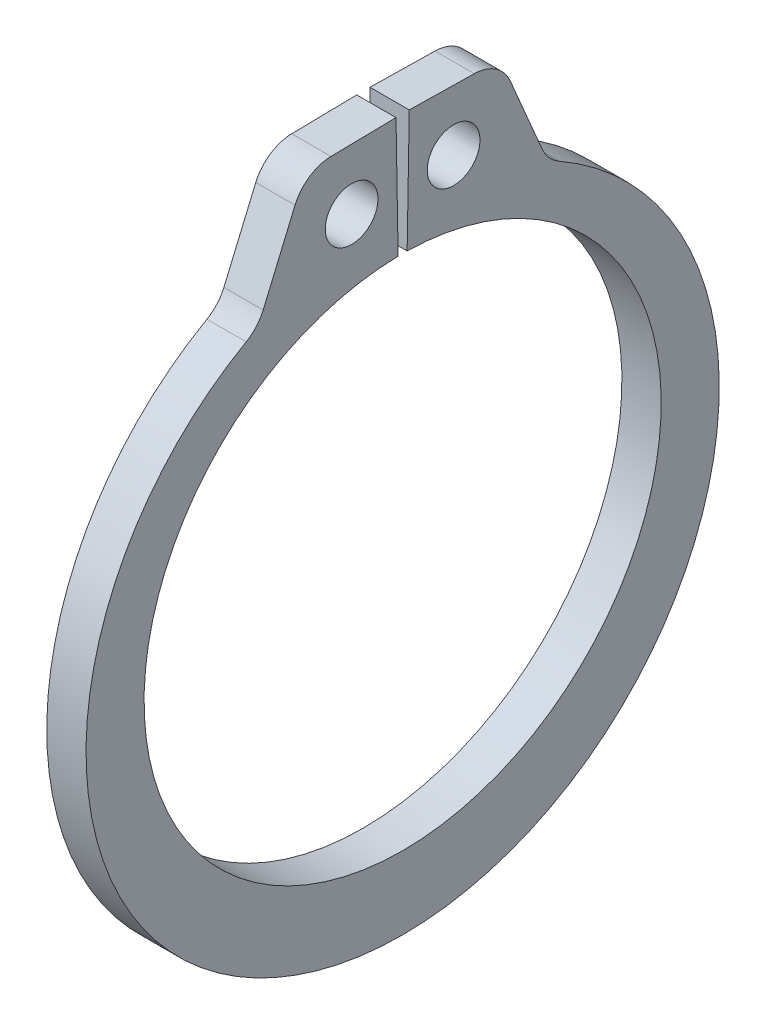
ISO-10303-21;
HEADER;
FILE_DESCRIPTION(('STEP AP214'),'2;1');
FILE_NAME('part.step','',(''),(''),'','','');
FILE_SCHEMA(('AUTOMOTIVE_DESIGN { 1 0 10303 214 1 1 1 1 }'));
ENDSEC;
DATA;
#1=APPLICATION_CONTEXT('core data for automotive mechanical design processes');
#2=APPLICATION_PROTOCOL_DEFINITION('international standard','automotive_design',2000,#1);
#3=PRODUCT_CONTEXT('',#1,'mechanical');
#4=PRODUCT('Part','Part','',(#3));
#5=PRODUCT_RELATED_PRODUCT_CATEGORY('part','',(#4));
#6=PRODUCT_DEFINITION_FORMATION('','',#4);
#7=PRODUCT_DEFINITION_CONTEXT('part definition',#1,'design');
#8=PRODUCT_DEFINITION('design','',#6,#7);
#9=PRODUCT_DEFINITION_SHAPE('','',#8);
#10=(LENGTH_UNIT() NAMED_UNIT(*) SI_UNIT(.MILLI.,.METRE.));
#11=(NAMED_UNIT(*) PLANE_ANGLE_UNIT() SI_UNIT($,.RADIAN.));
#12=(NAMED_UNIT(*) SI_UNIT($,.STERADIAN.) SOLID_ANGLE_UNIT());
#13=UNCERTAINTY_MEASURE_WITH_UNIT(LENGTH_MEASURE(1.E-05),#10,'distance_accuracy_value','');
#14=(GEOMETRIC_REPRESENTATION_CONTEXT(3) GLOBAL_UNCERTAINTY_ASSIGNED_CONTEXT((#13)) GLOBAL_UNIT_ASSIGNED_CONTEXT((#10,
#11,#12)) REPRESENTATION_CONTEXT('',''));
#15=CARTESIAN_POINT('',(0.,0.,0.));
#16=DIRECTION('',(0.,0.,1.));
#17=DIRECTION('',(1.,0.,0.));
#18=AXIS2_PLACEMENT_3D('',#15,#16,#17);
#19=CARTESIAN_POINT('',(-0.4445,0.,0.));
#20=DIRECTION('',(1.,0.,0.));
#21=DIRECTION('',(0.,0.,-1.));
#22=AXIS2_PLACEMENT_3D('',#19,#20,#21);
#23=PLANE('',#22);
#24=CARTESIAN_POINT('',(-0.4445,7.20724610900658,-1.15465964864512));
#25=DIRECTION('',(-1.,0.,0.));
#26=DIRECTION('',(0.,0.,1.));
#27=AXIS2_PLACEMENT_3D('',#24,#25,#26);
#28=CIRCLE('',#27,0.5969);
#29=CARTESIAN_POINT('',(-0.4445,7.20724610900658,-0.557759648645124));
#30=VERTEX_POINT('',#29);
#31=EDGE_CURVE('E132',#30,#30,#28,.F.);
#32=ORIENTED_EDGE('',*,*,#31,.T.);
#33=EDGE_LOOP('',(#32));
#34=FACE_BOUND('',#33,.T.);
#35=CARTESIAN_POINT('',(-0.4445,7.66933071962558,1.60650376158788));
#36=DIRECTION('',(-1.,0.,0.));
#37=DIRECTION('',(0.,0.,1.));
#38=AXIS2_PLACEMENT_3D('',#35,#36,#37);
#39=CIRCLE('',#38,0.9017);
#40=CARTESIAN_POINT('',(-0.4445,8.5708933863481,1.62224059647238));
#41=VERTEX_POINT('',#40);
#42=CARTESIAN_POINT('',(-0.4445,8.02240621636442,2.43620285379096));
#43=VERTEX_POINT('',#42);
#44=EDGE_CURVE('E102',#41,#43,#39,.F.);
#45=ORIENTED_EDGE('',*,*,#44,.F.);
#46=DIRECTION('',(0.,0.01745240643729,-0.999847695156391));
#47=VECTOR('',#46,1.);
#48=CARTESIAN_POINT('',(-0.4445,8.59659049818515,0.15005404530712));
#49=LINE('',#48,#47);
#50=CARTESIAN_POINT('',(-0.4445,8.59659049818515,0.15005404530712));
#51=VERTEX_POINT('',#50);
#52=EDGE_CURVE('E97',#41,#51,#49,.T.);
#53=ORIENTED_EDGE('',*,*,#52,.T.);
#54=DIRECTION('',(0.,-0.999847695156391,-0.0174524064372833));
#55=VECTOR('',#54,1.);
#56=CARTESIAN_POINT('',(-0.4445,5.85380830083213,0.102178603968365));
#57=LINE('',#56,#55);
#58=CARTESIAN_POINT('',(-0.4445,5.85380830083213,0.102178603968365));
#59=VERTEX_POINT('',#58);
#60=EDGE_CURVE('E129',#51,#59,#57,.T.);
#61=ORIENTED_EDGE('',*,*,#60,.T.);
#62=CARTESIAN_POINT('',(-0.4445,0.,0.));
#63=DIRECTION('',(-1.,0.,0.));
#64=DIRECTION('',(0.,0.,1.));
#65=AXIS2_PLACEMENT_3D('',#62,#63,#64);
#66=CIRCLE('',#65,5.8547);
#67=CARTESIAN_POINT('',(-0.4445,5.85380830083213,-0.102178603968365));
#68=VERTEX_POINT('',#67);
#69=EDGE_CURVE('E179',#59,#68,#66,.F.);
#70=ORIENTED_EDGE('',*,*,#69,.T.);
#71=DIRECTION('',(0.,0.999847695156391,-0.0174524064372833));
#72=VECTOR('',#71,1.);
#73=CARTESIAN_POINT('',(-0.4445,5.85380830083213,-0.102178603968365));
#74=LINE('',#73,#72);
#75=CARTESIAN_POINT('',(-0.4445,8.59659049818515,-0.15005404530712));
#76=VERTEX_POINT('',#75);
#77=EDGE_CURVE('E139',#68,#76,#74,.T.);
#78=ORIENTED_EDGE('',*,*,#77,.T.);
#79=DIRECTION('',(0.,-0.01745240643729,-0.999847695156391));
#80=VECTOR('',#79,1.);
#81=CARTESIAN_POINT('',(-0.4445,8.59659049818515,-0.15005404530712));
#82=LINE('',#81,#80);
#83=CARTESIAN_POINT('',(-0.4445,8.5708933863481,-1.62224059647238));
#84=VERTEX_POINT('',#83);
#85=EDGE_CURVE('E146',#76,#84,#82,.T.);
#86=ORIENTED_EDGE('',*,*,#85,.T.);
#87=CARTESIAN_POINT('',(-0.4445,7.66933071962558,-1.60650376158788));
#88=DIRECTION('',(-1.,0.,0.));
#89=DIRECTION('',(0.,0.,1.));
#90=AXIS2_PLACEMENT_3D('',#87,#88,#89);
#91=CIRCLE('',#90,0.9017);
#92=CARTESIAN_POINT('',(-0.4445,8.02240621636442,-2.43620285379096));
#93=VERTEX_POINT('',#92);
#94=EDGE_CURVE('E149',#93,#84,#91,.F.);
#95=ORIENTED_EDGE('',*,*,#94,.F.);
#96=DIRECTION('',(0.,-0.920149819455567,-0.391566481910656));
#97=VECTOR('',#96,1.);
#98=CARTESIAN_POINT('',(-0.4445,8.56068391718107,-2.20714069332188));
#99=LINE('',#98,#97);
#100=CARTESIAN_POINT('',(-0.4445,6.32616456625773,-3.15803245301383));
#101=VERTEX_POINT('',#100);
#102=EDGE_CURVE('E152',#93,#101,#99,.T.);
#103=ORIENTED_EDGE('',*,*,#102,.T.);
#104=CARTESIAN_POINT('',(-0.4445,6.67924006299657,-3.98773154521692));
#105=DIRECTION('',(-1.,0.,0.));
#106=DIRECTION('',(0.,0.,1.));
#107=AXIS2_PLACEMENT_3D('',#104,#105,#106);
#108=CIRCLE('',#107,0.9017);
#109=CARTESIAN_POINT('',(-0.4445,5.89530863003734,-3.54218199868087));
#110=VERTEX_POINT('',#109);
#111=EDGE_CURVE('E185',#101,#110,#108,.F.);
#112=ORIENTED_EDGE('',*,*,#111,.T.);
#113=CARTESIAN_POINT('',(-0.4445,-0.337057291142251,0.));
#114=DIRECTION('',(-1.,0.,0.));
#115=DIRECTION('',(0.,0.,1.));
#116=AXIS2_PLACEMENT_3D('',#113,#114,#115);
#117=CIRCLE('',#116,7.16864270885775);
#118=CARTESIAN_POINT('',(-0.4445,5.89530863003733,3.54218199868087));
#119=VERTEX_POINT('',#118);
#120=EDGE_CURVE('E187',#119,#110,#117,.F.);
#121=ORIENTED_EDGE('',*,*,#120,.F.);
#122=CARTESIAN_POINT('',(-0.4445,6.67924006299657,3.98773154521692));
#123=DIRECTION('',(-1.,0.,0.));
#124=DIRECTION('',(0.,0.,1.));
#125=AXIS2_PLACEMENT_3D('',#122,#123,#124);
#126=CIRCLE('',#125,0.9017);
#127=CARTESIAN_POINT('',(-0.4445,6.32616456625773,3.15803245301383));
#128=VERTEX_POINT('',#127);
#129=EDGE_CURVE('E115',#119,#128,#126,.F.);
#130=ORIENTED_EDGE('',*,*,#129,.T.);
#131=DIRECTION('',(0.,0.920149819455567,-0.391566481910656));
#132=VECTOR('',#131,1.);
#133=CARTESIAN_POINT('',(-0.4445,8.56068391718107,2.20714069332188));
#134=LINE('',#133,#132);
#135=EDGE_CURVE('E112',#128,#43,#134,.T.);
#136=ORIENTED_EDGE('',*,*,#135,.T.);
#137=EDGE_LOOP('',(#45,#53,#61,#70,#78,#86,#95,#103,#112,#121,#130,#136));
#138=FACE_BOUND('',#137,.T.);
#139=CARTESIAN_POINT('',(-0.4445,7.20724610900658,1.15465964864512));
#140=DIRECTION('',(-1.,0.,0.));
#141=DIRECTION('',(0.,0.,1.));
#142=AXIS2_PLACEMENT_3D('',#139,#140,#141);
#143=CIRCLE('',#142,0.5969);
#144=CARTESIAN_POINT('',(-0.4445,7.20724610900658,1.75155964864512));
#145=VERTEX_POINT('',#144);
#146=EDGE_CURVE('E19',#145,#145,#143,.F.);
#147=ORIENTED_EDGE('',*,*,#146,.T.);
#148=EDGE_LOOP('',(#147));
#149=FACE_BOUND('',#148,.T.);
#150=ADVANCED_FACE('F16',(#34,#138,#149),#23,.F.);
#151=CARTESIAN_POINT('',(0.4445,7.20724610900658,1.15465964864512));
#152=DIRECTION('',(-1.,0.,0.));
#153=DIRECTION('',(0.,0.,1.));
#154=AXIS2_PLACEMENT_3D('',#151,#152,#153);
#155=CYLINDRICAL_SURFACE('',#154,0.5969);
#156=CARTESIAN_POINT('',(0.4445,7.20724610900658,1.15465964864512));
#157=DIRECTION('',(-1.,0.,0.));
#158=DIRECTION('',(0.,0.,1.));
#159=AXIS2_PLACEMENT_3D('',#156,#157,#158);
#160=CIRCLE('',#159,0.5969);
#161=CARTESIAN_POINT('',(0.4445,7.20724610900658,1.75155964864512));
#162=VERTEX_POINT('',#161);
#163=EDGE_CURVE('E174',#162,#162,#160,.T.);
#164=ORIENTED_EDGE('',*,*,#163,.F.);
#165=EDGE_LOOP('',(#164));
#166=FACE_BOUND('',#165,.T.);
#167=ORIENTED_EDGE('',*,*,#146,.F.);
#168=EDGE_LOOP('',(#167));
#169=FACE_BOUND('',#168,.T.);
#170=ADVANCED_FACE('F387',(#166,#169),#155,.F.);
#171=CARTESIAN_POINT('',(0.4445,8.59659049818515,0.15005404530712));
#172=DIRECTION('',(0.,-0.999847695156391,-0.01745240643729));
#173=DIRECTION('',(0.,0.01745240643729,-0.999847695156391));
#174=AXIS2_PLACEMENT_3D('',#171,#172,#173);
#175=PLANE('',#174);
#176=DIRECTION('',(-1.,0.,0.));
#177=VECTOR('',#176,1.);
#178=CARTESIAN_POINT('',(0.4445,8.5708933863481,1.62224059647238));
#179=LINE('',#178,#177);
#180=CARTESIAN_POINT('',(0.4445,8.5708933863481,1.62224059647238));
#181=VERTEX_POINT('',#180);
#182=EDGE_CURVE('E109',#181,#41,#179,.T.);
#183=ORIENTED_EDGE('',*,*,#182,.F.);
#184=DIRECTION('',(0.,-0.0174524064372901,0.999847695156391));
#185=VECTOR('',#184,1.);
#186=CARTESIAN_POINT('',(0.4445,8.59659049818515,0.15005404530712));
#187=LINE('',#186,#185);
#188=CARTESIAN_POINT('',(0.4445,8.59659049818515,0.15005404530712));
#189=VERTEX_POINT('',#188);
#190=EDGE_CURVE('E173',#189,#181,#187,.T.);
#191=ORIENTED_EDGE('',*,*,#190,.F.);
#192=DIRECTION('',(1.,0.,0.));
#193=VECTOR('',#192,1.);
#194=CARTESIAN_POINT('',(0.4445,8.59659049818515,0.15005404530712));
#195=LINE('',#194,#193);
#196=EDGE_CURVE('E133',#189,#51,#195,.F.);
#197=ORIENTED_EDGE('',*,*,#196,.T.);
#198=ORIENTED_EDGE('',*,*,#52,.F.);
#199=EDGE_LOOP('',(#183,#191,#197,#198));
#200=FACE_BOUND('',#199,.T.);
#201=ADVANCED_FACE('F237',(#200),#175,.F.);
#202=CARTESIAN_POINT('',(0.4445,7.66933071962558,1.60650376158788));
#203=DIRECTION('',(-1.,0.,0.));
#204=DIRECTION('',(0.,0.,1.));
#205=AXIS2_PLACEMENT_3D('',#202,#203,#204);
#206=CYLINDRICAL_SURFACE('',#205,0.9017);
#207=ORIENTED_EDGE('',*,*,#44,.T.);
#208=DIRECTION('',(1.,0.,0.));
#209=VECTOR('',#208,1.);
#210=CARTESIAN_POINT('',(0.4445,8.02240621636442,2.43620285379096));
#211=LINE('',#210,#209);
#212=CARTESIAN_POINT('',(0.4445,8.02240621636442,2.43620285379096));
#213=VERTEX_POINT('',#212);
#214=EDGE_CURVE('E107',#43,#213,#211,.T.);
#215=ORIENTED_EDGE('',*,*,#214,.T.);
#216=CARTESIAN_POINT('',(0.4445,7.66933071962558,1.60650376158788));
#217=DIRECTION('',(-1.,0.,0.));
#218=DIRECTION('',(0.,0.,1.));
#219=AXIS2_PLACEMENT_3D('',#216,#217,#218);
#220=CIRCLE('',#219,0.9017);
#221=EDGE_CURVE('E171',#181,#213,#220,.F.);
#222=ORIENTED_EDGE('',*,*,#221,.F.);
#223=ORIENTED_EDGE('',*,*,#182,.T.);
#224=EDGE_LOOP('',(#207,#215,#222,#223));
#225=FACE_BOUND('',#224,.T.);
#226=ADVANCED_FACE('F104',(#225),#206,.T.);
#227=CARTESIAN_POINT('',(0.4445,8.56068391718107,2.20714069332188));
#228=DIRECTION('',(0.,-0.391566481910656,-0.920149819455567));
#229=DIRECTION('',(0.,0.920149819455567,-0.391566481910656));
#230=AXIS2_PLACEMENT_3D('',#227,#228,#229);
#231=PLANE('',#230);
#232=DIRECTION('',(-1.,0.,0.));
#233=VECTOR('',#232,1.);
#234=CARTESIAN_POINT('',(0.4445,6.32616456625773,3.15803245301383));
#235=LINE('',#234,#233);
#236=CARTESIAN_POINT('',(0.4445,6.32616456625773,3.15803245301383));
#237=VERTEX_POINT('',#236);
#238=EDGE_CURVE('E126',#128,#237,#235,.F.);
#239=ORIENTED_EDGE('',*,*,#238,.T.);
#240=DIRECTION('',(0.,-0.920149819455566,0.391566481910657));
#241=VECTOR('',#240,1.);
#242=CARTESIAN_POINT('',(0.4445,8.02240621636442,2.43620285379096));
#243=LINE('',#242,#241);
#244=EDGE_CURVE('E121',#213,#237,#243,.T.);
#245=ORIENTED_EDGE('',*,*,#244,.F.);
#246=ORIENTED_EDGE('',*,*,#214,.F.);
#247=ORIENTED_EDGE('',*,*,#135,.F.);
#248=EDGE_LOOP('',(#239,#245,#246,#247));
#249=FACE_BOUND('',#248,.T.);
#250=ADVANCED_FACE('F119',(#249),#231,.F.);
#251=CARTESIAN_POINT('',(0.4445,6.67924006299657,3.98773154521692));
#252=DIRECTION('',(-1.,0.,0.));
#253=DIRECTION('',(0.,0.,1.));
#254=AXIS2_PLACEMENT_3D('',#251,#252,#253);
#255=CYLINDRICAL_SURFACE('',#254,0.9017);
#256=ORIENTED_EDGE('',*,*,#238,.F.);
#257=ORIENTED_EDGE('',*,*,#129,.F.);
#258=DIRECTION('',(-1.,0.,0.));
#259=VECTOR('',#258,1.);
#260=CARTESIAN_POINT('',(0.4445,5.89530863003733,3.54218199868087));
#261=LINE('',#260,#259);
#262=CARTESIAN_POINT('',(0.4445,5.89530863003733,3.54218199868087));
#263=VERTEX_POINT('',#262);
#264=EDGE_CURVE('E190',#263,#119,#261,.T.);
#265=ORIENTED_EDGE('',*,*,#264,.F.);
#266=CARTESIAN_POINT('',(0.4445,6.67924006299657,3.98773154521692));
#267=DIRECTION('',(-1.,0.,0.));
#268=DIRECTION('',(0.,0.,1.));
#269=AXIS2_PLACEMENT_3D('',#266,#267,#268);
#270=CIRCLE('',#269,0.9017);
#271=EDGE_CURVE('E168',#237,#263,#270,.T.);
#272=ORIENTED_EDGE('',*,*,#271,.F.);
#273=EDGE_LOOP('',(#256,#257,#265,#272));
#274=FACE_BOUND('',#273,.T.);
#275=ADVANCED_FACE('F267',(#274),#255,.F.);
#276=CARTESIAN_POINT('',(0.4445,-0.337057291142251,0.));
#277=DIRECTION('',(-1.,0.,0.));
#278=DIRECTION('',(0.,0.,1.));
#279=AXIS2_PLACEMENT_3D('',#276,#277,#278);
#280=CYLINDRICAL_SURFACE('',#279,7.16864270885775);
#281=ORIENTED_EDGE('',*,*,#120,.T.);
#282=DIRECTION('',(-1.,0.,0.));
#283=VECTOR('',#282,1.);
#284=CARTESIAN_POINT('',(0.4445,5.89530863003733,-3.54218199868087));
#285=LINE('',#284,#283);
#286=CARTESIAN_POINT('',(0.4445,5.89530863003734,-3.54218199868087));
#287=VERTEX_POINT('',#286);
#288=EDGE_CURVE('E154',#110,#287,#285,.F.);
#289=ORIENTED_EDGE('',*,*,#288,.T.);
#290=CARTESIAN_POINT('',(0.4445,-0.337057291142251,0.));
#291=DIRECTION('',(-1.,0.,0.));
#292=DIRECTION('',(0.,0.,1.));
#293=AXIS2_PLACEMENT_3D('',#290,#291,#292);
#294=CIRCLE('',#293,7.16864270885775);
#295=EDGE_CURVE('E166',#263,#287,#294,.F.);
#296=ORIENTED_EDGE('',*,*,#295,.F.);
#297=ORIENTED_EDGE('',*,*,#264,.T.);
#298=EDGE_LOOP('',(#281,#289,#296,#297));
#299=FACE_BOUND('',#298,.T.);
#300=ADVANCED_FACE('F265',(#299),#280,.T.);
#301=CARTESIAN_POINT('',(0.4445,6.67924006299657,-3.98773154521692));
#302=DIRECTION('',(-1.,0.,0.));
#303=DIRECTION('',(0.,0.,1.));
#304=AXIS2_PLACEMENT_3D('',#301,#302,#303);
#305=CYLINDRICAL_SURFACE('',#304,0.9017);
#306=ORIENTED_EDGE('',*,*,#288,.F.);
#307=ORIENTED_EDGE('',*,*,#111,.F.);
#308=DIRECTION('',(1.,0.,0.));
#309=VECTOR('',#308,1.);
#310=CARTESIAN_POINT('',(0.4445,6.32616456625773,-3.15803245301383));
#311=LINE('',#310,#309);
#312=CARTESIAN_POINT('',(0.4445,6.32616456625773,-3.15803245301383));
#313=VERTEX_POINT('',#312);
#314=EDGE_CURVE('E153',#101,#313,#311,.T.);
#315=ORIENTED_EDGE('',*,*,#314,.T.);
#316=CARTESIAN_POINT('',(0.4445,6.67924006299657,-3.98773154521692));
#317=DIRECTION('',(-1.,0.,0.));
#318=DIRECTION('',(0.,0.,1.));
#319=AXIS2_PLACEMENT_3D('',#316,#317,#318);
#320=CIRCLE('',#319,0.9017);
#321=EDGE_CURVE('E163',#287,#313,#320,.T.);
#322=ORIENTED_EDGE('',*,*,#321,.F.);
#323=EDGE_LOOP('',(#306,#307,#315,#322));
#324=FACE_BOUND('',#323,.T.);
#325=ADVANCED_FACE('F263',(#324),#305,.F.);
#326=CARTESIAN_POINT('',(0.4445,8.56068391718107,-2.20714069332188));
#327=DIRECTION('',(0.,-0.391566481910656,0.920149819455567));
#328=DIRECTION('',(0.,-0.920149819455567,-0.391566481910656));
#329=AXIS2_PLACEMENT_3D('',#326,#327,#328);
#330=PLANE('',#329);
#331=ORIENTED_EDGE('',*,*,#314,.F.);
#332=ORIENTED_EDGE('',*,*,#102,.F.);
#333=DIRECTION('',(-1.,0.,0.));
#334=VECTOR('',#333,1.);
#335=CARTESIAN_POINT('',(0.4445,8.02240621636442,-2.43620285379096));
#336=LINE('',#335,#334);
#337=CARTESIAN_POINT('',(0.4445,8.02240621636442,-2.43620285379096));
#338=VERTEX_POINT('',#337);
#339=EDGE_CURVE('E184',#338,#93,#336,.T.);
#340=ORIENTED_EDGE('',*,*,#339,.F.);
#341=DIRECTION('',(0.,0.920149819455566,0.391566481910657));
#342=VECTOR('',#341,1.);
#343=CARTESIAN_POINT('',(0.4445,6.32616456625773,-3.15803245301383));
#344=LINE('',#343,#342);
#345=EDGE_CURVE('E162',#313,#338,#344,.T.);
#346=ORIENTED_EDGE('',*,*,#345,.F.);
#347=EDGE_LOOP('',(#331,#332,#340,#346));
#348=FACE_BOUND('',#347,.T.);
#349=ADVANCED_FACE('F259',(#348),#330,.F.);
#350=CARTESIAN_POINT('',(0.4445,7.66933071962558,-1.60650376158788));
#351=DIRECTION('',(-1.,0.,0.));
#352=DIRECTION('',(0.,0.,1.));
#353=AXIS2_PLACEMENT_3D('',#350,#351,#352);
#354=CYLINDRICAL_SURFACE('',#353,0.9017);
#355=ORIENTED_EDGE('',*,*,#94,.T.);
#356=DIRECTION('',(1.,0.,0.));
#357=VECTOR('',#356,1.);
#358=CARTESIAN_POINT('',(0.4445,8.5708933863481,-1.62224059647238));
#359=LINE('',#358,#357);
#360=CARTESIAN_POINT('',(0.4445,8.5708933863481,-1.62224059647238));
#361=VERTEX_POINT('',#360);
#362=EDGE_CURVE('E148',#84,#361,#359,.T.);
#363=ORIENTED_EDGE('',*,*,#362,.T.);
#364=CARTESIAN_POINT('',(0.4445,7.66933071962558,-1.60650376158788));
#365=DIRECTION('',(-1.,0.,0.));
#366=DIRECTION('',(0.,0.,1.));
#367=AXIS2_PLACEMENT_3D('',#364,#365,#366);
#368=CIRCLE('',#367,0.9017);
#369=EDGE_CURVE('E158',#338,#361,#368,.F.);
#370=ORIENTED_EDGE('',*,*,#369,.F.);
#371=ORIENTED_EDGE('',*,*,#339,.T.);
#372=EDGE_LOOP('',(#355,#363,#370,#371));
#373=FACE_BOUND('',#372,.T.);
#374=ADVANCED_FACE('F254',(#373),#354,.T.);
#375=CARTESIAN_POINT('',(0.4445,8.59659049818515,-0.15005404530712));
#376=DIRECTION('',(0.,-0.999847695156391,0.01745240643729));
#377=DIRECTION('',(0.,-0.01745240643729,-0.999847695156391));
#378=AXIS2_PLACEMENT_3D('',#375,#376,#377);
#379=PLANE('',#378);
#380=ORIENTED_EDGE('',*,*,#362,.F.);
#381=ORIENTED_EDGE('',*,*,#85,.F.);
#382=DIRECTION('',(1.,0.,0.));
#383=VECTOR('',#382,1.);
#384=CARTESIAN_POINT('',(0.4445,8.59659049818515,-0.15005404530712));
#385=LINE('',#384,#383);
#386=CARTESIAN_POINT('',(0.4445,8.59659049818515,-0.15005404530712));
#387=VERTEX_POINT('',#386);
#388=EDGE_CURVE('E143',#76,#387,#385,.T.);
#389=ORIENTED_EDGE('',*,*,#388,.T.);
#390=DIRECTION('',(0.,0.0174524064372901,0.999847695156391));
#391=VECTOR('',#390,1.);
#392=CARTESIAN_POINT('',(0.4445,8.5708933863481,-1.62224059647238));
#393=LINE('',#392,#391);
#394=EDGE_CURVE('E161',#361,#387,#393,.T.);
#395=ORIENTED_EDGE('',*,*,#394,.F.);
#396=EDGE_LOOP('',(#380,#381,#389,#395));
#397=FACE_BOUND('',#396,.T.);
#398=ADVANCED_FACE('F251',(#397),#379,.F.);
#399=CARTESIAN_POINT('',(0.4445,5.85380830083213,-0.102178603968365));
#400=DIRECTION('',(0.,-0.0174524064372833,-0.999847695156391));
#401=DIRECTION('',(0.,0.999847695156391,-0.0174524064372833));
#402=AXIS2_PLACEMENT_3D('',#399,#400,#401);
#403=PLANE('',#402);
#404=DIRECTION('',(-1.,0.,0.));
#405=VECTOR('',#404,1.);
#406=CARTESIAN_POINT('',(0.4445,5.85380830083213,-0.102178603968365));
#407=LINE('',#406,#405);
#408=CARTESIAN_POINT('',(0.4445,5.85380830083213,-0.102178603968365));
#409=VERTEX_POINT('',#408);
#410=EDGE_CURVE('E142',#68,#409,#407,.F.);
#411=ORIENTED_EDGE('',*,*,#410,.T.);
#412=DIRECTION('',(0.,-0.999847695156391,0.0174524064372833));
#413=VECTOR('',#412,1.);
#414=CARTESIAN_POINT('',(0.4445,8.59659049818515,-0.15005404530712));
#415=LINE('',#414,#413);
#416=EDGE_CURVE('E157',#387,#409,#415,.T.);
#417=ORIENTED_EDGE('',*,*,#416,.F.);
#418=ORIENTED_EDGE('',*,*,#388,.F.);
#419=ORIENTED_EDGE('',*,*,#77,.F.);
#420=EDGE_LOOP('',(#411,#417,#418,#419));
#421=FACE_BOUND('',#420,.T.);
#422=ADVANCED_FACE('F243',(#421),#403,.F.);
#423=CARTESIAN_POINT('',(0.4445,0.,0.));
#424=DIRECTION('',(-1.,0.,0.));
#425=DIRECTION('',(0.,0.,1.));
#426=AXIS2_PLACEMENT_3D('',#423,#424,#425);
#427=CYLINDRICAL_SURFACE('',#426,5.8547);
#428=DIRECTION('',(1.,0.,0.));
#429=VECTOR('',#428,1.);
#430=CARTESIAN_POINT('',(0.4445,5.85380830083213,0.102178603968365));
#431=LINE('',#430,#429);
#432=CARTESIAN_POINT('',(0.4445,5.85380830083213,0.102178603968365));
#433=VERTEX_POINT('',#432);
#434=EDGE_CURVE('E181',#59,#433,#431,.T.);
#435=ORIENTED_EDGE('',*,*,#434,.T.);
#436=CARTESIAN_POINT('',(0.4445,0.,0.));
#437=DIRECTION('',(-1.,0.,0.));
#438=DIRECTION('',(0.,0.,1.));
#439=AXIS2_PLACEMENT_3D('',#436,#437,#438);
#440=CIRCLE('',#439,5.8547);
#441=EDGE_CURVE('E34',#409,#433,#440,.T.);
#442=ORIENTED_EDGE('',*,*,#441,.F.);
#443=ORIENTED_EDGE('',*,*,#410,.F.);
#444=ORIENTED_EDGE('',*,*,#69,.F.);
#445=EDGE_LOOP('',(#435,#442,#443,#444));
#446=FACE_BOUND('',#445,.T.);
#447=ADVANCED_FACE('F245',(#446),#427,.F.);
#448=CARTESIAN_POINT('',(0.4445,5.85380830083213,0.102178603968365));
#449=DIRECTION('',(0.,-0.0174524064372833,0.999847695156391));
#450=DIRECTION('',(0.,-0.999847695156391,-0.0174524064372833));
#451=AXIS2_PLACEMENT_3D('',#448,#449,#450);
#452=PLANE('',#451);
#453=ORIENTED_EDGE('',*,*,#196,.F.);
#454=DIRECTION('',(0.,0.999847695156391,0.0174524064372833));
#455=VECTOR('',#454,1.);
#456=CARTESIAN_POINT('',(0.4445,5.85380830083213,0.102178603968365));
#457=LINE('',#456,#455);
#458=EDGE_CURVE('E25',#433,#189,#457,.T.);
#459=ORIENTED_EDGE('',*,*,#458,.F.);
#460=ORIENTED_EDGE('',*,*,#434,.F.);
#461=ORIENTED_EDGE('',*,*,#60,.F.);
#462=EDGE_LOOP('',(#453,#459,#460,#461));
#463=FACE_BOUND('',#462,.T.);
#464=ADVANCED_FACE('F235',(#463),#452,.F.);
#465=CARTESIAN_POINT('',(0.4445,7.20724610900658,-1.15465964864512));
#466=DIRECTION('',(-1.,0.,0.));
#467=DIRECTION('',(0.,0.,1.));
#468=AXIS2_PLACEMENT_3D('',#465,#466,#467);
#469=CYLINDRICAL_SURFACE('',#468,0.5969);
#470=CARTESIAN_POINT('',(0.4445,7.20724610900658,-1.15465964864512));
#471=DIRECTION('',(-1.,0.,0.));
#472=DIRECTION('',(0.,0.,1.));
#473=AXIS2_PLACEMENT_3D('',#470,#471,#472);
#474=CIRCLE('',#473,0.5969);
#475=CARTESIAN_POINT('',(0.4445,7.20724610900658,-0.557759648645124));
#476=VERTEX_POINT('',#475);
#477=EDGE_CURVE('E11',#476,#476,#474,.T.);
#478=ORIENTED_EDGE('',*,*,#477,.F.);
#479=EDGE_LOOP('',(#478));
#480=FACE_BOUND('',#479,.T.);
#481=ORIENTED_EDGE('',*,*,#31,.F.);
#482=EDGE_LOOP('',(#481));
#483=FACE_BOUND('',#482,.T.);
#484=ADVANCED_FACE('F278',(#480,#483),#469,.F.);
#485=CARTESIAN_POINT('',(0.4445,0.,0.));
#486=DIRECTION('',(1.,0.,0.));
#487=DIRECTION('',(0.,0.,-1.));
#488=AXIS2_PLACEMENT_3D('',#485,#486,#487);
#489=PLANE('',#488);
#490=ORIENTED_EDGE('',*,*,#477,.T.);
#491=EDGE_LOOP('',(#490));
#492=FACE_BOUND('',#491,.T.);
#493=ORIENTED_EDGE('',*,*,#441,.T.);
#494=ORIENTED_EDGE('',*,*,#458,.T.);
#495=ORIENTED_EDGE('',*,*,#190,.T.);
#496=ORIENTED_EDGE('',*,*,#221,.T.);
#497=ORIENTED_EDGE('',*,*,#244,.T.);
#498=ORIENTED_EDGE('',*,*,#271,.T.);
#499=ORIENTED_EDGE('',*,*,#295,.T.);
#500=ORIENTED_EDGE('',*,*,#321,.T.);
#501=ORIENTED_EDGE('',*,*,#345,.T.);
#502=ORIENTED_EDGE('',*,*,#369,.T.);
#503=ORIENTED_EDGE('',*,*,#394,.T.);
#504=ORIENTED_EDGE('',*,*,#416,.T.);
#505=EDGE_LOOP('',(#493,#494,#495,#496,#497,#498,#499,#500,#501,#502,#503,#504));
#506=FACE_BOUND('',#505,.T.);
#507=ORIENTED_EDGE('',*,*,#163,.T.);
#508=EDGE_LOOP('',(#507));
#509=FACE_BOUND('',#508,.T.);
#510=ADVANCED_FACE('F228',(#492,#506,#509),#489,.T.);
#511=CLOSED_SHELL('',(#150,#170,#201,#226,#250,#275,#300,#325,#349,#374,#398,#422,#447,#464,
#484,#510));
#512=MANIFOLD_SOLID_BREP('B1',#511);
#513=ADVANCED_BREP_SHAPE_REPRESENTATION('',(#18,#512),#14);
#514=SHAPE_DEFINITION_REPRESENTATION(#9,#513);
ENDSEC;
END-ISO-10303-21;
